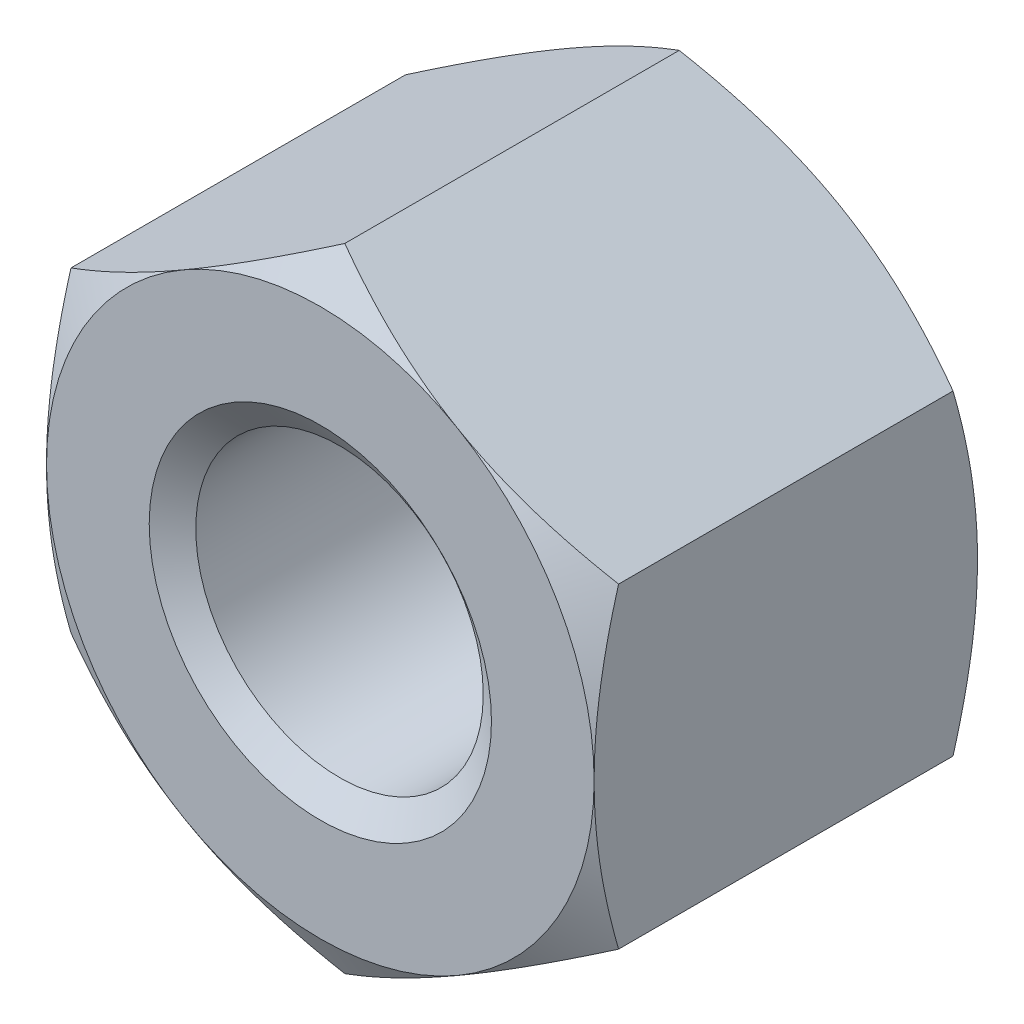
ISO-10303-21;
HEADER;
FILE_DESCRIPTION(('STEP AP214'),'2;1');
FILE_NAME('part.step','',(''),(''),'','','');
FILE_SCHEMA(('AUTOMOTIVE_DESIGN { 1 0 10303 214 1 1 1 1 }'));
ENDSEC;
DATA;
#1=APPLICATION_CONTEXT('core data for automotive mechanical design processes');
#2=APPLICATION_PROTOCOL_DEFINITION('international standard','automotive_design',2000,#1);
#3=PRODUCT_CONTEXT('',#1,'mechanical');
#4=PRODUCT('Part','Part','',(#3));
#5=PRODUCT_RELATED_PRODUCT_CATEGORY('part','',(#4));
#6=PRODUCT_DEFINITION_FORMATION('','',#4);
#7=PRODUCT_DEFINITION_CONTEXT('part definition',#1,'design');
#8=PRODUCT_DEFINITION('design','',#6,#7);
#9=PRODUCT_DEFINITION_SHAPE('','',#8);
#10=(LENGTH_UNIT() NAMED_UNIT(*) SI_UNIT(.MILLI.,.METRE.));
#11=(NAMED_UNIT(*) PLANE_ANGLE_UNIT() SI_UNIT($,.RADIAN.));
#12=(NAMED_UNIT(*) SI_UNIT($,.STERADIAN.) SOLID_ANGLE_UNIT());
#13=UNCERTAINTY_MEASURE_WITH_UNIT(LENGTH_MEASURE(1.E-05),#10,'distance_accuracy_value','');
#14=(GEOMETRIC_REPRESENTATION_CONTEXT(3) GLOBAL_UNCERTAINTY_ASSIGNED_CONTEXT((#13)) GLOBAL_UNIT_ASSIGNED_CONTEXT((#10,
#11,#12)) REPRESENTATION_CONTEXT('',''));
#15=CARTESIAN_POINT('',(0.,0.,0.));
#16=DIRECTION('',(0.,0.,1.));
#17=DIRECTION('',(1.,0.,0.));
#18=AXIS2_PLACEMENT_3D('',#15,#16,#17);
#19=CARTESIAN_POINT('',(0.,0.,-5.6));
#20=DIRECTION('',(0.,0.,1.));
#21=DIRECTION('',(1.,0.,0.));
#22=AXIS2_PLACEMENT_3D('',#19,#20,#21);
#23=CYLINDRICAL_SURFACE('',#22,2.1);
#24=CARTESIAN_POINT('',(0.,0.,-0.280083015283883));
#25=DIRECTION('',(0.,0.,1.));
#26=DIRECTION('',(1.,0.,0.));
#27=AXIS2_PLACEMENT_3D('',#24,#25,#26);
#28=CIRCLE('',#27,2.1);
#29=CARTESIAN_POINT('',(2.1,0.,-0.280083015283883));
#30=VERTEX_POINT('',#29);
#31=EDGE_CURVE('E170',#30,#30,#28,.F.);
#32=ORIENTED_EDGE('',*,*,#31,.F.);
#33=EDGE_LOOP('',(#32));
#34=FACE_BOUND('',#33,.T.);
#35=CARTESIAN_POINT('',(0.,0.,-5.29451698471611));
#36=DIRECTION('',(0.,0.,-1.));
#37=DIRECTION('',(-1.,0.,0.));
#38=AXIS2_PLACEMENT_3D('',#35,#36,#37);
#39=CIRCLE('',#38,2.1);
#40=CARTESIAN_POINT('',(-2.1,0.,-5.29451698471611));
#41=VERTEX_POINT('',#40);
#42=EDGE_CURVE('E35',#41,#41,#39,.F.);
#43=ORIENTED_EDGE('',*,*,#42,.F.);
#44=EDGE_LOOP('',(#43));
#45=FACE_BOUND('',#44,.T.);
#46=ADVANCED_FACE('F30',(#34,#45),#23,.F.);
#47=CARTESIAN_POINT('',(0.,4.61880215351702,-5.6));
#48=DIRECTION('',(0.,0.,-1.));
#49=DIRECTION('',(-1.,0.,0.));
#50=AXIS2_PLACEMENT_3D('',#47,#48,#49);
#51=PLANE('',#50);
#52=CARTESIAN_POINT('',(0.,0.,-5.6));
#53=DIRECTION('',(0.,0.,-1.));
#54=DIRECTION('',(-1.,0.,0.));
#55=AXIS2_PLACEMENT_3D('',#52,#53,#54);
#56=CIRCLE('',#55,4.);
#57=CARTESIAN_POINT('',(-4.,0.,-5.6));
#58=VERTEX_POINT('',#57);
#59=CARTESIAN_POINT('',(-2.00000000000002,-3.46410161513774,-5.6));
#60=VERTEX_POINT('',#59);
#61=EDGE_CURVE('E166',#58,#60,#56,.F.);
#62=ORIENTED_EDGE('',*,*,#61,.F.);
#63=CARTESIAN_POINT('',(-2.00000000000001,3.46410161513775,-5.6));
#64=VERTEX_POINT('',#63);
#65=EDGE_CURVE('E148',#64,#58,#56,.F.);
#66=ORIENTED_EDGE('',*,*,#65,.F.);
#67=CARTESIAN_POINT('',(2.00000000000003,3.46410161513774,-5.6));
#68=VERTEX_POINT('',#67);
#69=EDGE_CURVE('E165',#68,#64,#56,.F.);
#70=ORIENTED_EDGE('',*,*,#69,.F.);
#71=CARTESIAN_POINT('',(0.,0.,-5.6));
#72=DIRECTION('',(0.,0.,1.));
#73=DIRECTION('',(1.,0.,0.));
#74=AXIS2_PLACEMENT_3D('',#71,#72,#73);
#75=CIRCLE('',#74,4.);
#76=CARTESIAN_POINT('',(4.,0.,-5.6));
#77=VERTEX_POINT('',#76);
#78=EDGE_CURVE('E240',#77,#68,#75,.T.);
#79=ORIENTED_EDGE('',*,*,#78,.F.);
#80=CARTESIAN_POINT('',(2.00000000000001,-3.46410161513775,-5.6));
#81=VERTEX_POINT('',#80);
#82=EDGE_CURVE('E356',#81,#77,#56,.F.);
#83=ORIENTED_EDGE('',*,*,#82,.F.);
#84=EDGE_CURVE('E360',#60,#81,#56,.F.);
#85=ORIENTED_EDGE('',*,*,#84,.F.);
#86=EDGE_LOOP('',(#62,#66,#70,#79,#83,#85));
#87=FACE_BOUND('',#86,.T.);
#88=CARTESIAN_POINT('',(0.,0.,-5.6));
#89=DIRECTION('',(0.,0.,-1.));
#90=DIRECTION('',(-1.,0.,0.));
#91=AXIS2_PLACEMENT_3D('',#88,#89,#90);
#92=CIRCLE('',#91,2.5);
#93=CARTESIAN_POINT('',(-2.5,0.,-5.6));
#94=VERTEX_POINT('',#93);
#95=EDGE_CURVE('E173',#94,#94,#92,.F.);
#96=ORIENTED_EDGE('',*,*,#95,.T.);
#97=EDGE_LOOP('',(#96));
#98=FACE_BOUND('',#97,.T.);
#99=ADVANCED_FACE('F293',(#87,#98),#51,.T.);
#100=CARTESIAN_POINT('',(0.,4.61880215351702,0.));
#101=DIRECTION('',(0.,0.,-1.));
#102=DIRECTION('',(-1.,0.,0.));
#103=AXIS2_PLACEMENT_3D('',#100,#101,#102);
#104=PLANE('',#103);
#105=CARTESIAN_POINT('',(0.,0.,0.));
#106=DIRECTION('',(0.,0.,-1.));
#107=DIRECTION('',(-1.,0.,0.));
#108=AXIS2_PLACEMENT_3D('',#105,#106,#107);
#109=CIRCLE('',#108,4.);
#110=CARTESIAN_POINT('',(-4.,0.,0.));
#111=VERTEX_POINT('',#110);
#112=CARTESIAN_POINT('',(-2.00000000000001,3.46410161513775,0.));
#113=VERTEX_POINT('',#112);
#114=EDGE_CURVE('E11',#111,#113,#109,.T.);
#115=ORIENTED_EDGE('',*,*,#114,.F.);
#116=CARTESIAN_POINT('',(-2.00000000000002,-3.46410161513774,0.));
#117=VERTEX_POINT('',#116);
#118=EDGE_CURVE('E42',#117,#111,#109,.T.);
#119=ORIENTED_EDGE('',*,*,#118,.F.);
#120=CARTESIAN_POINT('',(2.00000000000001,-3.46410161513775,0.));
#121=VERTEX_POINT('',#120);
#122=EDGE_CURVE('E169',#121,#117,#109,.T.);
#123=ORIENTED_EDGE('',*,*,#122,.F.);
#124=CARTESIAN_POINT('',(4.,0.,0.));
#125=VERTEX_POINT('',#124);
#126=EDGE_CURVE('E347',#125,#121,#109,.T.);
#127=ORIENTED_EDGE('',*,*,#126,.F.);
#128=CARTESIAN_POINT('',(0.,0.,0.));
#129=DIRECTION('',(0.,0.,1.));
#130=DIRECTION('',(1.,0.,0.));
#131=AXIS2_PLACEMENT_3D('',#128,#129,#130);
#132=CIRCLE('',#131,4.);
#133=CARTESIAN_POINT('',(2.00000000000003,3.46410161513774,0.));
#134=VERTEX_POINT('',#133);
#135=EDGE_CURVE('E124',#125,#134,#132,.T.);
#136=ORIENTED_EDGE('',*,*,#135,.T.);
#137=EDGE_CURVE('E40',#113,#134,#109,.T.);
#138=ORIENTED_EDGE('',*,*,#137,.F.);
#139=EDGE_LOOP('',(#115,#119,#123,#127,#136,#138));
#140=FACE_BOUND('',#139,.T.);
#141=CARTESIAN_POINT('',(0.,0.,0.));
#142=DIRECTION('',(0.,0.,1.));
#143=DIRECTION('',(1.,0.,0.));
#144=AXIS2_PLACEMENT_3D('',#141,#142,#143);
#145=CIRCLE('',#144,2.5);
#146=CARTESIAN_POINT('',(2.5,0.,0.));
#147=VERTEX_POINT('',#146);
#148=EDGE_CURVE('E172',#147,#147,#145,.T.);
#149=ORIENTED_EDGE('',*,*,#148,.F.);
#150=EDGE_LOOP('',(#149));
#151=FACE_BOUND('',#150,.T.);
#152=ADVANCED_FACE('F245',(#140,#151),#104,.F.);
#153=CARTESIAN_POINT('',(0.,4.61880215351702,-5.6));
#154=DIRECTION('',(-0.500000000000002,0.866025403784437,0.));
#155=DIRECTION('',(-0.866025403784437,-0.500000000000002,0.));
#156=AXIS2_PLACEMENT_3D('',#153,#154,#155);
#157=PLANE('',#156);
#158=DIRECTION('',(0.,0.,1.));
#159=VECTOR('',#158,1.);
#160=CARTESIAN_POINT('',(-4.,2.3094010767585,-5.6));
#161=LINE('',#160,#159);
#162=CARTESIAN_POINT('',(-4.,2.30940107675853,-5.24273441009183));
#163=VERTEX_POINT('',#162);
#164=CARTESIAN_POINT('',(-4.,2.3094010767585,-0.357265589908163));
#165=VERTEX_POINT('',#164);
#166=EDGE_CURVE('E160',#163,#165,#161,.T.);
#167=ORIENTED_EDGE('',*,*,#166,.T.);
#168=CARTESIAN_POINT('',(-4.0002,2.30928560670466,-0.357332259074767));
#169=CARTESIAN_POINT('',(-3.82442084967677,2.4107717464617,-0.298717873648282));
#170=CARTESIAN_POINT('',(-3.64712438367362,2.51313390883499,-0.245410321462262));
#171=CARTESIAN_POINT('',(-3.28946140682429,2.71963072479811,-0.152361670746403));
#172=CARTESIAN_POINT('',(-3.10908854102985,2.82376904741904,-0.112653489029703));
#173=CARTESIAN_POINT('',(-2.75057818129721,3.03075510011795,-0.0508422152802778));
#174=CARTESIAN_POINT('',(-2.57249584706486,3.13357098372491,-0.0283277315228875));
#175=CARTESIAN_POINT('',(-2.21549328283349,3.33968651028528,-0.00145062314658082));
#176=CARTESIAN_POINT('',(-2.0365743503559,3.44298540411434,0.00293425857305745));
#177=CARTESIAN_POINT('',(-1.70225715780327,3.63600352522932,-0.00619007293997034));
#178=CARTESIAN_POINT('',(-1.54680884001293,3.72575165335065,-0.0174589539879949));
#179=CARTESIAN_POINT('',(-1.23692494436494,3.90466320392055,-0.0531739907981951));
#180=CARTESIAN_POINT('',(-1.08249043825587,3.99382600759479,-0.0776323457115357));
#181=CARTESIAN_POINT('',(-0.771967672225416,4.17310641015198,-0.138776064919294));
#182=CARTESIAN_POINT('',(-0.61591871193689,4.26320131938132,-0.175720603654869));
#183=CARTESIAN_POINT('',(-0.306148164596151,4.44204742827552,-0.259570072548035));
#184=CARTESIAN_POINT('',(-0.15242260922621,4.53080091904968,-0.306455302212749));
#185=CARTESIAN_POINT('',(0.000200000000011907,4.61891762357086,-0.357332259074778));
#186=B_SPLINE_CURVE_WITH_KNOTS('',3,(#168,#169,#170,#171,#172,#173,#174,#175,#176,#177,#178,
#179,#180,#181,#182,#183,#184,#185),.UNSPECIFIED.,.F.,.F.,(4,2,2,2,2,2,2,2,4),(0.,
0.634047835695967,1.26961969224544,1.88946157213122,2.50854226669297,3.04757825393386,
3.58711366126904,4.13861653143765,4.68903648037745),.UNSPECIFIED.);
#187=EDGE_CURVE('E129',#165,#113,#186,.T.);
#188=ORIENTED_EDGE('',*,*,#187,.T.);
#189=CARTESIAN_POINT('',(0.,4.61880215351702,-0.357265589908173));
#190=VERTEX_POINT('',#189);
#191=EDGE_CURVE('E49',#113,#190,#186,.T.);
#192=ORIENTED_EDGE('',*,*,#191,.T.);
#193=DIRECTION('',(0.,0.,1.));
#194=VECTOR('',#193,1.);
#195=CARTESIAN_POINT('',(0.,4.61880215351702,-5.6));
#196=LINE('',#195,#194);
#197=CARTESIAN_POINT('',(0.,4.61880215351702,-5.24273441009183));
#198=VERTEX_POINT('',#197);
#199=EDGE_CURVE('E145',#198,#190,#196,.T.);
#200=ORIENTED_EDGE('',*,*,#199,.F.);
#201=CARTESIAN_POINT('',(-4.0002,2.30928560670466,-5.24266774092523));
#202=CARTESIAN_POINT('',(-3.82442084967677,2.4107717464617,-5.30128212635172));
#203=CARTESIAN_POINT('',(-3.64712438367362,2.51313390883499,-5.35458967853774));
#204=CARTESIAN_POINT('',(-3.28946140682429,2.71963072479811,-5.4476383292536));
#205=CARTESIAN_POINT('',(-3.10908854102985,2.82376904741904,-5.4873465109703));
#206=CARTESIAN_POINT('',(-2.75057818129721,3.03075510011795,-5.54915778471972));
#207=CARTESIAN_POINT('',(-2.57249584706486,3.13357098372491,-5.57167226847711));
#208=CARTESIAN_POINT('',(-2.21549328283349,3.33968651028528,-5.59854937685342));
#209=CARTESIAN_POINT('',(-2.0365743503559,3.44298540411434,-5.60293425857306));
#210=CARTESIAN_POINT('',(-1.70225715780327,3.63600352522932,-5.59380992706003));
#211=CARTESIAN_POINT('',(-1.54680884001293,3.72575165335065,-5.58254104601201));
#212=CARTESIAN_POINT('',(-1.23692494436494,3.90466320392055,-5.54682600920181));
#213=CARTESIAN_POINT('',(-1.08249043825587,3.99382600759479,-5.52236765428847));
#214=CARTESIAN_POINT('',(-0.771967672225416,4.17310641015198,-5.46122393508071));
#215=CARTESIAN_POINT('',(-0.61591871193689,4.26320131938132,-5.42427939634513));
#216=CARTESIAN_POINT('',(-0.306148164596151,4.44204742827552,-5.34042992745197));
#217=CARTESIAN_POINT('',(-0.15242260922621,4.53080091904968,-5.29354469778725));
#218=CARTESIAN_POINT('',(0.000200000000011775,4.61891762357086,-5.24266774092522));
#219=B_SPLINE_CURVE_WITH_KNOTS('',3,(#201,#202,#203,#204,#205,#206,#207,#208,#209,#210,#211,
#212,#213,#214,#215,#216,#217,#218),.UNSPECIFIED.,.F.,.F.,(4,2,2,2,2,2,2,2,4),(0.,
0.634047835695967,1.26961969224544,1.88946157213122,2.50854226669297,3.04757825393386,
3.58711366126905,4.13861653143765,4.68903648037745),.UNSPECIFIED.);
#220=EDGE_CURVE('E163',#64,#198,#219,.T.);
#221=ORIENTED_EDGE('',*,*,#220,.F.);
#222=EDGE_CURVE('E255',#163,#64,#219,.T.);
#223=ORIENTED_EDGE('',*,*,#222,.F.);
#224=EDGE_LOOP('',(#167,#188,#192,#200,#221,#223));
#225=FACE_BOUND('',#224,.T.);
#226=ADVANCED_FACE('F32',(#225),#157,.T.);
#227=CARTESIAN_POINT('',(4.,2.30940107675848,-5.6));
#228=DIRECTION('',(0.500000000000007,0.866025403784435,0.));
#229=DIRECTION('',(-0.866025403784435,0.500000000000007,0.));
#230=AXIS2_PLACEMENT_3D('',#227,#228,#229);
#231=PLANE('',#230);
#232=ORIENTED_EDGE('',*,*,#199,.T.);
#233=CARTESIAN_POINT('',(-0.00019999999998845,4.61891762357086,-0.357332259074777));
#234=CARTESIAN_POINT('',(0.175579150323239,4.51743148381382,-0.298717873648291));
#235=CARTESIAN_POINT('',(0.352875616326392,4.41506932144053,-0.245410321462271));
#236=CARTESIAN_POINT('',(0.710538593175717,4.2085725054774,-0.15236167074641));
#237=CARTESIAN_POINT('',(0.890911458970161,4.10443418285647,-0.112653489029709));
#238=CARTESIAN_POINT('',(1.2494218187028,3.89744813015756,-0.0508422152802821));
#239=CARTESIAN_POINT('',(1.42750415293515,3.79463224655059,-0.0283277315228906));
#240=CARTESIAN_POINT('',(1.78450671716652,3.58851671999022,-0.00145062314658197));
#241=CARTESIAN_POINT('',(1.96342564964411,3.48521782616116,0.00293425857305705));
#242=CARTESIAN_POINT('',(2.29774284219674,3.29219970504618,-0.00619007293996901));
#243=CARTESIAN_POINT('',(2.45319115998708,3.20245157692485,-0.0174589539879924));
#244=CARTESIAN_POINT('',(2.76307505563506,3.02354002635495,-0.0531739907981907));
#245=CARTESIAN_POINT('',(2.91750956174414,2.93437722268071,-0.0776323457115305));
#246=CARTESIAN_POINT('',(3.22803232777459,2.75509682012352,-0.138776064919287));
#247=CARTESIAN_POINT('',(3.38408128806311,2.66500191089418,-0.175720603654861));
#248=CARTESIAN_POINT('',(3.69385183540384,2.48615580199999,-0.259570072548024));
#249=CARTESIAN_POINT('',(3.84757739077378,2.39740231122583,-0.306455302212737));
#250=CARTESIAN_POINT('',(4.0002,2.30928560670464,-0.357332259074764));
#251=B_SPLINE_CURVE_WITH_KNOTS('',3,(#233,#234,#235,#236,#237,#238,#239,#240,#241,#242,#243,
#244,#245,#246,#247,#248,#249,#250),.UNSPECIFIED.,.F.,.F.,(4,2,2,2,2,2,2,2,4),(0.,
0.634047835695968,1.26961969224544,1.88946157213123,2.50854226669298,3.04757825393387,
3.58711366126905,4.13861653143765,4.68903648037745),.UNSPECIFIED.);
#252=EDGE_CURVE('E139',#190,#134,#251,.T.);
#253=ORIENTED_EDGE('',*,*,#252,.T.);
#254=CARTESIAN_POINT('',(4.,2.30940107675852,-0.357265589908173));
#255=VERTEX_POINT('',#254);
#256=EDGE_CURVE('E56',#134,#255,#251,.T.);
#257=ORIENTED_EDGE('',*,*,#256,.T.);
#258=DIRECTION('',(0.,0.,1.));
#259=VECTOR('',#258,1.);
#260=CARTESIAN_POINT('',(4.,2.30940107675848,-5.6));
#261=LINE('',#260,#259);
#262=CARTESIAN_POINT('',(4.,2.30940107675852,-5.24273441009183));
#263=VERTEX_POINT('',#262);
#264=EDGE_CURVE('E138',#263,#255,#261,.T.);
#265=ORIENTED_EDGE('',*,*,#264,.F.);
#266=CARTESIAN_POINT('',(-0.00019999999998845,4.61891762357086,-5.24266774092522));
#267=CARTESIAN_POINT('',(0.17557915032324,4.51743148381382,-5.30128212635171));
#268=CARTESIAN_POINT('',(0.352875616326392,4.41506932144053,-5.35458967853773));
#269=CARTESIAN_POINT('',(0.710538593175717,4.2085725054774,-5.44763832925359));
#270=CARTESIAN_POINT('',(0.890911458970162,4.10443418285647,-5.48734651097029));
#271=CARTESIAN_POINT('',(1.2494218187028,3.89744813015756,-5.54915778471972));
#272=CARTESIAN_POINT('',(1.42750415293515,3.79463224655059,-5.57167226847711));
#273=CARTESIAN_POINT('',(1.78450671716652,3.58851671999022,-5.59854937685342));
#274=CARTESIAN_POINT('',(1.96342564964411,3.48521782616116,-5.60293425857306));
#275=CARTESIAN_POINT('',(2.29774284219674,3.29219970504618,-5.59380992706003));
#276=CARTESIAN_POINT('',(2.45319115998708,3.20245157692485,-5.58254104601201));
#277=CARTESIAN_POINT('',(2.76307505563506,3.02354002635495,-5.54682600920181));
#278=CARTESIAN_POINT('',(2.91750956174414,2.93437722268071,-5.52236765428847));
#279=CARTESIAN_POINT('',(3.22803232777458,2.75509682012352,-5.46122393508071));
#280=CARTESIAN_POINT('',(3.38408128806311,2.66500191089418,-5.42427939634514));
#281=CARTESIAN_POINT('',(3.69385183540384,2.48615580199999,-5.34042992745198));
#282=CARTESIAN_POINT('',(3.84757739077378,2.39740231122583,-5.29354469778726));
#283=CARTESIAN_POINT('',(4.0002,2.30928560670464,-5.24266774092524));
#284=B_SPLINE_CURVE_WITH_KNOTS('',3,(#266,#267,#268,#269,#270,#271,#272,#273,#274,#275,#276,
#277,#278,#279,#280,#281,#282,#283),.UNSPECIFIED.,.F.,.F.,(4,2,2,2,2,2,2,2,4),(0.,
0.634047835695969,1.26961969224544,1.88946157213123,2.50854226669298,3.04757825393387,
3.58711366126904,4.13861653143765,4.68903648037745),.UNSPECIFIED.);
#285=EDGE_CURVE('E249',#68,#263,#284,.T.);
#286=ORIENTED_EDGE('',*,*,#285,.F.);
#287=EDGE_CURVE('E254',#198,#68,#284,.T.);
#288=ORIENTED_EDGE('',*,*,#287,.F.);
#289=EDGE_LOOP('',(#232,#253,#257,#265,#286,#288));
#290=FACE_BOUND('',#289,.T.);
#291=ADVANCED_FACE('F136',(#290),#231,.T.);
#292=CARTESIAN_POINT('',(4.,2.30940107675848,-5.6));
#293=DIRECTION('',(-1.,0.,0.));
#294=DIRECTION('',(0.,0.,1.));
#295=AXIS2_PLACEMENT_3D('',#292,#293,#294);
#296=PLANE('',#295);
#297=CARTESIAN_POINT('',(4.,-6.12487198995896,-1.91410682124067));
#298=CARTESIAN_POINT('',(4.,-5.9492493703868,-1.82923627076692));
#299=CARTESIAN_POINT('',(4.,-5.7732115209529,-1.74520940380742));
#300=CARTESIAN_POINT('',(4.,-5.42008084777958,-1.57932514679719));
#301=CARTESIAN_POINT('',(4.,-5.24298784779931,-1.49746813236725));
#302=CARTESIAN_POINT('',(4.,-4.88656571686338,-1.33597446305858));
#303=CARTESIAN_POINT('',(4.,-4.70722958889366,-1.25635319506306));
#304=CARTESIAN_POINT('',(4.,-4.34708334747267,-1.10053058542032));
#305=CARTESIAN_POINT('',(4.,-4.16627331143541,-1.02432906550804));
#306=CARTESIAN_POINT('',(4.,-3.80064706744981,-0.875350650394381));
#307=CARTESIAN_POINT('',(4.,-3.61580892822773,-0.802627284215863));
#308=CARTESIAN_POINT('',(4.,-3.24395246794972,-0.662876230959436));
#309=CARTESIAN_POINT('',(4.,-3.05693390695805,-0.59584917756652));
#310=CARTESIAN_POINT('',(4.,-2.68080318253774,-0.469291748430896));
#311=CARTESIAN_POINT('',(4.,-2.49169643712852,-0.409745434783851));
#312=CARTESIAN_POINT('',(4.,-2.11079454635854,-0.300083356544518));
#313=CARTESIAN_POINT('',(4.,-1.91900027185752,-0.249964609676762));
#314=CARTESIAN_POINT('',(4.,-1.53259232698203,-0.16159079495405));
#315=CARTESIAN_POINT('',(4.,-1.33797792031653,-0.123338885956548));
#316=CARTESIAN_POINT('',(4.,-0.946402725872582,-0.0612742359223494));
#317=CARTESIAN_POINT('',(4.,-0.749441936019801,-0.0374615076517037));
#318=CARTESIAN_POINT('',(4.,-0.355451989627968,-0.00638181314943936));
#319=CARTESIAN_POINT('',(4.,-0.158431311094036,0.000989900761038723));
#320=CARTESIAN_POINT('',(4.,0.235472085607446,-0.00120406637479726));
#321=CARTESIAN_POINT('',(4.,0.432354826312183,-0.0107653508153518));
#322=CARTESIAN_POINT('',(4.,0.768560635225494,-0.040878734613591));
#323=CARTESIAN_POINT('',(4.,0.908254618381796,-0.0575092960439096));
#324=CARTESIAN_POINT('',(4.,1.18656349063495,-0.0982134103466906));
#325=CARTESIAN_POINT('',(4.,1.32517820601011,-0.122288137058445));
#326=CARTESIAN_POINT('',(4.,1.73929045452966,-0.204415070950227));
#327=CARTESIAN_POINT('',(4.,2.01284690528719,-0.272348886425149));
#328=CARTESIAN_POINT('',(4.,2.4221825301452,-0.389516359317197));
#329=CARTESIAN_POINT('',(4.,2.56009536361535,-0.43171394181163));
#330=CARTESIAN_POINT('',(4.,2.834481591014,-0.520284580227754));
#331=CARTESIAN_POINT('',(4.,2.97095590623554,-0.566654756186904));
#332=CARTESIAN_POINT('',(4.,3.24189440516337,-0.662605699180277));
#333=CARTESIAN_POINT('',(4.,3.37636557946834,-0.712166925753491));
#334=CARTESIAN_POINT('',(4.,3.6442646115291,-0.814198353790692));
#335=CARTESIAN_POINT('',(4.,3.77769202239383,-0.866669730963359));
#336=CARTESIAN_POINT('',(4.,3.9106369898668,-0.920309006541781));
#337=B_SPLINE_CURVE_WITH_KNOTS('',3,(#297,#298,#299,#300,#301,#302,#303,#304,#305,#306,#307,
#308,#309,#310,#311,#312,#313,#314,#315,#316,#317,#318,#319,#320,#321,#322,#323,#324,#325,#326,
#327,#328,#329,#330,#331,#332,#333,#334,#335,#336),.UNSPECIFIED.,.F.,.F.,(4,2,2,2,2,2,2,2,2,2,2,
2,2,2,2,2,2,2,2,4),(0.,0.585171792532274,1.17044423059927,1.7590659464599,2.34765694284827,
2.94347400997484,3.5393572721069,4.13394864697602,4.72835161391473,5.32291267067847,
5.91747425310815,6.50823685854039,7.09884609659889,7.52068140825524,7.94258327130842,
8.78701491359831,9.2196528189769,9.65199437116298,10.0819024146297,10.5119854255247),.UNSPECIFIED.);
#338=CARTESIAN_POINT('',(3.99999999999999,-2.30940107675855,-0.357265589908173));
#339=VERTEX_POINT('',#338);
#340=EDGE_CURVE('E131',#339,#125,#337,.T.);
#341=ORIENTED_EDGE('',*,*,#340,.F.);
#342=DIRECTION('',(0.,0.,1.));
#343=VECTOR('',#342,1.);
#344=CARTESIAN_POINT('',(4.,-2.30940107675854,-5.6));
#345=LINE('',#344,#343);
#346=CARTESIAN_POINT('',(3.99999999999999,-2.30940107675855,-5.24273441009183));
#347=VERTEX_POINT('',#346);
#348=EDGE_CURVE('E146',#347,#339,#345,.T.);
#349=ORIENTED_EDGE('',*,*,#348,.F.);
#350=CARTESIAN_POINT('',(4.,-6.12487198995896,-3.68589317875933));
#351=CARTESIAN_POINT('',(4.,-5.9492493703868,-3.77076372923308));
#352=CARTESIAN_POINT('',(4.,-5.7732115209529,-3.85479059619258));
#353=CARTESIAN_POINT('',(4.,-5.42008084777958,-4.02067485320281));
#354=CARTESIAN_POINT('',(4.,-5.24298784779932,-4.10253186763275));
#355=CARTESIAN_POINT('',(4.,-4.88656571686338,-4.26402553694142));
#356=CARTESIAN_POINT('',(4.,-4.70722958889366,-4.34364680493694));
#357=CARTESIAN_POINT('',(4.,-4.34708334747267,-4.49946941457968));
#358=CARTESIAN_POINT('',(4.,-4.16627331143541,-4.57567093449196));
#359=CARTESIAN_POINT('',(4.,-3.80064706744981,-4.72464934960562));
#360=CARTESIAN_POINT('',(4.,-3.61580892822773,-4.79737271578414));
#361=CARTESIAN_POINT('',(4.,-3.24395246794972,-4.93712376904056));
#362=CARTESIAN_POINT('',(4.,-3.05693390695805,-5.00415082243348));
#363=CARTESIAN_POINT('',(4.,-2.68080318253774,-5.13070825156911));
#364=CARTESIAN_POINT('',(4.,-2.49169643712852,-5.19025456521615));
#365=CARTESIAN_POINT('',(4.,-2.11079454635854,-5.29991664345548));
#366=CARTESIAN_POINT('',(4.,-1.91900027185752,-5.35003539032324));
#367=CARTESIAN_POINT('',(4.,-1.53259232698203,-5.43840920504595));
#368=CARTESIAN_POINT('',(4.,-1.33797792031653,-5.47666111404345));
#369=CARTESIAN_POINT('',(4.,-0.946402725872582,-5.53872576407765));
#370=CARTESIAN_POINT('',(4.,-0.749441936019801,-5.5625384923483));
#371=CARTESIAN_POINT('',(4.,-0.355451989627969,-5.59361818685056));
#372=CARTESIAN_POINT('',(4.,-0.158431311094036,-5.60098990076104));
#373=CARTESIAN_POINT('',(4.,0.235472085607445,-5.5987959336252));
#374=CARTESIAN_POINT('',(4.,0.432354826312183,-5.58923464918465));
#375=CARTESIAN_POINT('',(4.,0.768560635225494,-5.55912126538641));
#376=CARTESIAN_POINT('',(4.,0.908254618381795,-5.54249070395609));
#377=CARTESIAN_POINT('',(4.,1.18656349063495,-5.50178658965331));
#378=CARTESIAN_POINT('',(4.,1.32517820601011,-5.47771186294156));
#379=CARTESIAN_POINT('',(4.,1.73929045452966,-5.39558492904977));
#380=CARTESIAN_POINT('',(4.,2.01284690528719,-5.32765111357485));
#381=CARTESIAN_POINT('',(4.,2.4221825301452,-5.2104836406828));
#382=CARTESIAN_POINT('',(4.,2.56009536361535,-5.16828605818837));
#383=CARTESIAN_POINT('',(4.,2.834481591014,-5.07971541977225));
#384=CARTESIAN_POINT('',(4.,2.97095590623554,-5.0333452438131));
#385=CARTESIAN_POINT('',(4.,3.24189440516337,-4.93739430081972));
#386=CARTESIAN_POINT('',(4.,3.37636557946834,-4.88783307424651));
#387=CARTESIAN_POINT('',(4.,3.6442646115291,-4.78580164620931));
#388=CARTESIAN_POINT('',(4.,3.77769202239383,-4.73333026903664));
#389=CARTESIAN_POINT('',(4.,3.9106369898668,-4.67969099345822));
#390=B_SPLINE_CURVE_WITH_KNOTS('',3,(#350,#351,#352,#353,#354,#355,#356,#357,#358,#359,#360,
#361,#362,#363,#364,#365,#366,#367,#368,#369,#370,#371,#372,#373,#374,#375,#376,#377,#378,#379,
#380,#381,#382,#383,#384,#385,#386,#387,#388,#389),.UNSPECIFIED.,.F.,.F.,(4,2,2,2,2,2,2,2,2,2,2,
2,2,2,2,2,2,2,2,4),(0.,0.585171792532273,1.17044423059927,1.7590659464599,2.34765694284827,
2.94347400997484,3.5393572721069,4.13394864697602,4.72835161391472,5.32291267067847,
5.91747425310815,6.50823685854039,7.09884609659889,7.52068140825523,7.94258327130841,
8.78701491359831,9.2196528189769,9.65199437116298,10.0819024146297,10.5119854255247),.UNSPECIFIED.);
#391=EDGE_CURVE('E261',#347,#77,#390,.T.);
#392=ORIENTED_EDGE('',*,*,#391,.T.);
#393=EDGE_CURVE('E144',#77,#263,#390,.T.);
#394=ORIENTED_EDGE('',*,*,#393,.T.);
#395=ORIENTED_EDGE('',*,*,#264,.T.);
#396=EDGE_CURVE('E121',#125,#255,#337,.T.);
#397=ORIENTED_EDGE('',*,*,#396,.F.);
#398=EDGE_LOOP('',(#341,#349,#392,#394,#395,#397));
#399=FACE_BOUND('',#398,.T.);
#400=ADVANCED_FACE('F142',(#399),#296,.F.);
#401=CARTESIAN_POINT('',(0.,-4.61880215351706,-5.6));
#402=DIRECTION('',(0.500000000000003,-0.866025403784437,0.));
#403=DIRECTION('',(0.866025403784437,0.500000000000003,0.));
#404=AXIS2_PLACEMENT_3D('',#401,#402,#403);
#405=PLANE('',#404);
#406=ORIENTED_EDGE('',*,*,#348,.T.);
#407=CARTESIAN_POINT('',(4.0002,-2.3092856067047,-0.357332259074782));
#408=CARTESIAN_POINT('',(3.82442084967677,-2.41077174646174,-0.298717873648298));
#409=CARTESIAN_POINT('',(3.64712438367362,-2.51313390883503,-0.245410321462278));
#410=CARTESIAN_POINT('',(3.28946140682429,-2.71963072479816,-0.15236167074642));
#411=CARTESIAN_POINT('',(3.10908854102985,-2.82376904741909,-0.112653489029721));
#412=CARTESIAN_POINT('',(2.75057818129721,-3.030755100118,-0.0508422152802971));
#413=CARTESIAN_POINT('',(2.57249584706485,-3.13357098372496,-0.028327731522908));
#414=CARTESIAN_POINT('',(2.21549328283349,-3.33968651028533,-0.00145062314660313));
#415=CARTESIAN_POINT('',(2.03657435035589,-3.44298540411439,0.00293425857303443));
#416=CARTESIAN_POINT('',(1.70225715780326,-3.63600352522937,-0.0061900729399952));
#417=CARTESIAN_POINT('',(1.54680884001293,-3.7257516533507,-0.0174589539880206));
#418=CARTESIAN_POINT('',(1.23692494436494,-3.9046632039206,-0.0531739907982214));
#419=CARTESIAN_POINT('',(1.08249043825586,-3.99382600759484,-0.077632345711562));
#420=CARTESIAN_POINT('',(0.771967672225417,-4.17310641015202,-0.13877606491932));
#421=CARTESIAN_POINT('',(0.615918711936894,-4.26320131938137,-0.175720603654895));
#422=CARTESIAN_POINT('',(0.306148164596158,-4.44204742827556,-0.25957007254806));
#423=CARTESIAN_POINT('',(0.152422609226218,-4.53080091904972,-0.306455302212774));
#424=CARTESIAN_POINT('',(-0.000200000000002422,-4.6189176235709,-0.357332259074802));
#425=B_SPLINE_CURVE_WITH_KNOTS('',3,(#407,#408,#409,#410,#411,#412,#413,#414,#415,#416,#417,
#418,#419,#420,#421,#422,#423,#424),.UNSPECIFIED.,.F.,.F.,(4,2,2,2,2,2,2,2,4),(0.,
0.63404783569597,1.26961969224544,1.88946157213123,2.50854226669299,3.04757825393387,
3.58711366126905,4.13861653143765,4.68903648037745),.UNSPECIFIED.);
#426=EDGE_CURVE('E342',#339,#121,#425,.T.);
#427=ORIENTED_EDGE('',*,*,#426,.T.);
#428=CARTESIAN_POINT('',(0.,-4.61880215351702,-0.357265589908173));
#429=VERTEX_POINT('',#428);
#430=EDGE_CURVE('E221',#121,#429,#425,.T.);
#431=ORIENTED_EDGE('',*,*,#430,.T.);
#432=DIRECTION('',(0.,0.,1.));
#433=VECTOR('',#432,1.);
#434=CARTESIAN_POINT('',(0.,-4.61880215351706,-5.6));
#435=LINE('',#434,#433);
#436=CARTESIAN_POINT('',(0.,-4.61880215351702,-5.24273441009183));
#437=VERTEX_POINT('',#436);
#438=EDGE_CURVE('E151',#437,#429,#435,.T.);
#439=ORIENTED_EDGE('',*,*,#438,.F.);
#440=CARTESIAN_POINT('',(4.0002,-2.3092856067047,-5.24266774092522));
#441=CARTESIAN_POINT('',(3.82442084967678,-2.41077174646174,-5.3012821263517));
#442=CARTESIAN_POINT('',(3.64712438367362,-2.51313390883503,-5.35458967853772));
#443=CARTESIAN_POINT('',(3.28946140682429,-2.71963072479816,-5.44763832925358));
#444=CARTESIAN_POINT('',(3.10908854102985,-2.82376904741909,-5.48734651097028));
#445=CARTESIAN_POINT('',(2.75057818129721,-3.030755100118,-5.5491577847197));
#446=CARTESIAN_POINT('',(2.57249584706485,-3.13357098372496,-5.57167226847709));
#447=CARTESIAN_POINT('',(2.21549328283349,-3.33968651028533,-5.5985493768534));
#448=CARTESIAN_POINT('',(2.03657435035589,-3.44298540411439,-5.60293425857304));
#449=CARTESIAN_POINT('',(1.70225715780326,-3.63600352522937,-5.59380992706001));
#450=CARTESIAN_POINT('',(1.54680884001293,-3.7257516533507,-5.58254104601198));
#451=CARTESIAN_POINT('',(1.23692494436494,-3.9046632039206,-5.54682600920178));
#452=CARTESIAN_POINT('',(1.08249043825586,-3.99382600759484,-5.52236765428844));
#453=CARTESIAN_POINT('',(0.771967672225418,-4.17310641015202,-5.46122393508068));
#454=CARTESIAN_POINT('',(0.615918711936894,-4.26320131938136,-5.42427939634511));
#455=CARTESIAN_POINT('',(0.306148164596157,-4.44204742827556,-5.34042992745194));
#456=CARTESIAN_POINT('',(0.152422609226217,-4.53080091904972,-5.29354469778723));
#457=CARTESIAN_POINT('',(-0.000200000000002432,-4.6189176235709,-5.2426677409252));
#458=B_SPLINE_CURVE_WITH_KNOTS('',3,(#440,#441,#442,#443,#444,#445,#446,#447,#448,#449,#450,
#451,#452,#453,#454,#455,#456,#457),.UNSPECIFIED.,.F.,.F.,(4,2,2,2,2,2,2,2,4),(0.,
0.63404783569597,1.26961969224544,1.88946157213123,2.50854226669299,3.04757825393387,
3.58711366126905,4.13861653143765,4.68903648037745),.UNSPECIFIED.);
#459=EDGE_CURVE('E267',#81,#437,#458,.T.);
#460=ORIENTED_EDGE('',*,*,#459,.F.);
#461=EDGE_CURVE('E266',#347,#81,#458,.T.);
#462=ORIENTED_EDGE('',*,*,#461,.F.);
#463=EDGE_LOOP('',(#406,#427,#431,#439,#460,#462));
#464=FACE_BOUND('',#463,.T.);
#465=ADVANCED_FACE('F277',(#464),#405,.T.);
#466=CARTESIAN_POINT('',(-4.,-2.30940107675853,-5.6));
#467=DIRECTION('',(-0.500000000000006,-0.866025403784435,0.));
#468=DIRECTION('',(0.866025403784436,-0.500000000000006,0.));
#469=AXIS2_PLACEMENT_3D('',#466,#467,#468);
#470=PLANE('',#469);
#471=ORIENTED_EDGE('',*,*,#438,.T.);
#472=CARTESIAN_POINT('',(0.000199999999997729,-4.6189176235709,-0.357332259074802));
#473=CARTESIAN_POINT('',(-0.175579150323232,-4.51743148381386,-0.298717873648315));
#474=CARTESIAN_POINT('',(-0.352875616326386,-4.41506932144057,-0.245410321462294));
#475=CARTESIAN_POINT('',(-0.710538593175715,-4.20857250547744,-0.152361670746431));
#476=CARTESIAN_POINT('',(-0.890911458970161,-4.10443418285651,-0.112653489029731));
#477=CARTESIAN_POINT('',(-1.2494218187028,-3.8974481301576,-0.0508422152803029));
#478=CARTESIAN_POINT('',(-1.42750415293516,-3.79463224655063,-0.0283277315229116));
#479=CARTESIAN_POINT('',(-1.78450671716653,-3.58851671999026,-0.00145062314660233));
#480=CARTESIAN_POINT('',(-1.96342564964412,-3.4852178261612,0.00293425857303738));
#481=CARTESIAN_POINT('',(-2.29774284219675,-3.29219970504621,-0.00619007293998834));
#482=CARTESIAN_POINT('',(-2.45319115998708,-3.20245157692489,-0.0174589539880117));
#483=CARTESIAN_POINT('',(-2.76307505563507,-3.02354002635499,-0.0531739907982092));
#484=CARTESIAN_POINT('',(-2.91750956174414,-2.93437722268075,-0.0776323457115483));
#485=CARTESIAN_POINT('',(-3.22803232777459,-2.75509682012356,-0.138776064919303));
#486=CARTESIAN_POINT('',(-3.38408128806311,-2.66500191089422,-0.175720603654876));
#487=CARTESIAN_POINT('',(-3.69385183540384,-2.48615580200003,-0.259570072548038));
#488=CARTESIAN_POINT('',(-3.84757739077378,-2.39740231122587,-0.30645530221275));
#489=CARTESIAN_POINT('',(-4.0002,-2.30928560670469,-0.357332259074776));
#490=B_SPLINE_CURVE_WITH_KNOTS('',3,(#472,#473,#474,#475,#476,#477,#478,#479,#480,#481,#482,
#483,#484,#485,#486,#487,#488,#489),.UNSPECIFIED.,.F.,.F.,(4,2,2,2,2,2,2,2,4),(0.,
0.634047835695975,1.26961969224545,1.88946157213125,2.508542266693,3.04757825393389,
3.58711366126906,4.13861653143766,4.68903648037745),.UNSPECIFIED.);
#491=EDGE_CURVE('E340',#429,#117,#490,.T.);
#492=ORIENTED_EDGE('',*,*,#491,.T.);
#493=CARTESIAN_POINT('',(-4.,-2.30940107675853,-0.357265589908173));
#494=VERTEX_POINT('',#493);
#495=EDGE_CURVE('E195',#117,#494,#490,.T.);
#496=ORIENTED_EDGE('',*,*,#495,.T.);
#497=DIRECTION('',(0.,0.,1.));
#498=VECTOR('',#497,1.);
#499=CARTESIAN_POINT('',(-4.,-2.30940107675853,-5.6));
#500=LINE('',#499,#498);
#501=CARTESIAN_POINT('',(-4.,-2.30940107675853,-5.24273441009183));
#502=VERTEX_POINT('',#501);
#503=EDGE_CURVE('E157',#502,#494,#500,.T.);
#504=ORIENTED_EDGE('',*,*,#503,.F.);
#505=CARTESIAN_POINT('',(0.000199999999997729,-4.6189176235709,-5.2426677409252));
#506=CARTESIAN_POINT('',(-0.175579150323232,-4.51743148381386,-5.30128212635169));
#507=CARTESIAN_POINT('',(-0.352875616326386,-4.41506932144057,-5.35458967853771));
#508=CARTESIAN_POINT('',(-0.710538593175715,-4.20857250547744,-5.44763832925357));
#509=CARTESIAN_POINT('',(-0.890911458970161,-4.10443418285651,-5.48734651097027));
#510=CARTESIAN_POINT('',(-1.2494218187028,-3.8974481301576,-5.5491577847197));
#511=CARTESIAN_POINT('',(-1.42750415293516,-3.79463224655063,-5.57167226847709));
#512=CARTESIAN_POINT('',(-1.78450671716653,-3.58851671999026,-5.5985493768534));
#513=CARTESIAN_POINT('',(-1.96342564964412,-3.4852178261612,-5.60293425857304));
#514=CARTESIAN_POINT('',(-2.29774284219675,-3.29219970504621,-5.59380992706001));
#515=CARTESIAN_POINT('',(-2.45319115998708,-3.20245157692489,-5.58254104601199));
#516=CARTESIAN_POINT('',(-2.76307505563507,-3.02354002635499,-5.54682600920179));
#517=CARTESIAN_POINT('',(-2.91750956174414,-2.93437722268075,-5.52236765428845));
#518=CARTESIAN_POINT('',(-3.22803232777459,-2.75509682012356,-5.4612239350807));
#519=CARTESIAN_POINT('',(-3.38408128806311,-2.66500191089422,-5.42427939634513));
#520=CARTESIAN_POINT('',(-3.69385183540384,-2.48615580200003,-5.34042992745196));
#521=CARTESIAN_POINT('',(-3.84757739077378,-2.39740231122587,-5.29354469778725));
#522=CARTESIAN_POINT('',(-4.0002,-2.30928560670469,-5.24266774092523));
#523=B_SPLINE_CURVE_WITH_KNOTS('',3,(#505,#506,#507,#508,#509,#510,#511,#512,#513,#514,#515,
#516,#517,#518,#519,#520,#521,#522),.UNSPECIFIED.,.F.,.F.,(4,2,2,2,2,2,2,2,4),(0.,
0.634047835695974,1.26961969224545,1.88946157213125,2.508542266693,3.04757825393389,
3.58711366126906,4.13861653143766,4.68903648037745),.UNSPECIFIED.);
#524=EDGE_CURVE('E273',#60,#502,#523,.T.);
#525=ORIENTED_EDGE('',*,*,#524,.F.);
#526=EDGE_CURVE('E272',#437,#60,#523,.T.);
#527=ORIENTED_EDGE('',*,*,#526,.F.);
#528=EDGE_LOOP('',(#471,#492,#496,#504,#525,#527));
#529=FACE_BOUND('',#528,.T.);
#530=ADVANCED_FACE('F280',(#529),#470,.T.);
#531=CARTESIAN_POINT('',(-4.,2.3094010767585,-5.6));
#532=DIRECTION('',(-1.,0.,0.));
#533=DIRECTION('',(0.,0.,1.));
#534=AXIS2_PLACEMENT_3D('',#531,#532,#533);
#535=PLANE('',#534);
#536=ORIENTED_EDGE('',*,*,#503,.T.);
#537=CARTESIAN_POINT('',(-4.,-6.12487198995894,-1.91410682124066));
#538=CARTESIAN_POINT('',(-4.,-5.94924937038678,-1.82923627076691));
#539=CARTESIAN_POINT('',(-4.,-5.77321152095288,-1.74520940380741));
#540=CARTESIAN_POINT('',(-4.,-5.42008084777957,-1.57932514679718));
#541=CARTESIAN_POINT('',(-4.,-5.2429878477993,-1.49746813236724));
#542=CARTESIAN_POINT('',(-4.,-4.88656571686336,-1.33597446305857));
#543=CARTESIAN_POINT('',(-4.,-4.70722958889364,-1.25635319506305));
#544=CARTESIAN_POINT('',(-4.,-4.34708334747265,-1.10053058542031));
#545=CARTESIAN_POINT('',(-4.,-4.16627331143539,-1.02432906550803));
#546=CARTESIAN_POINT('',(-4.,-3.80064706744979,-0.875350650394372));
#547=CARTESIAN_POINT('',(-4.,-3.61580892822772,-0.802627284215855));
#548=CARTESIAN_POINT('',(-4.,-3.2439524679497,-0.662876230959429));
#549=CARTESIAN_POINT('',(-4.,-3.05693390695803,-0.595849177566513));
#550=CARTESIAN_POINT('',(-4.,-2.68080318253772,-0.46929174843089));
#551=CARTESIAN_POINT('',(-4.,-2.4916964371285,-0.409745434783845));
#552=CARTESIAN_POINT('',(-4.,-2.11079454635853,-0.300083356544513));
#553=CARTESIAN_POINT('',(-4.,-1.91900027185751,-0.249964609676757));
#554=CARTESIAN_POINT('',(-4.,-1.53259232698202,-0.161590794954046));
#555=CARTESIAN_POINT('',(-4.,-1.33797792031651,-0.123338885956544));
#556=CARTESIAN_POINT('',(-4.,-0.94640272587257,-0.0612742359223458));
#557=CARTESIAN_POINT('',(-4.,-0.74944193601979,-0.0374615076517008));
#558=CARTESIAN_POINT('',(-4.,-0.355451989627958,-0.00638181314943724));
#559=CARTESIAN_POINT('',(-4.,-0.158431311094026,0.00098990076104085));
#560=CARTESIAN_POINT('',(-4.,0.235472085607455,-0.00120406637479538));
#561=CARTESIAN_POINT('',(-4.,0.432354826312192,-0.0107653508153502));
#562=CARTESIAN_POINT('',(-4.,0.768560635225504,-0.0408787346135896));
#563=CARTESIAN_POINT('',(-4.,0.908254618381806,-0.0575092960439083));
#564=CARTESIAN_POINT('',(-4.,1.18656349063496,-0.0982134103466898));
#565=CARTESIAN_POINT('',(-4.,1.32517820601012,-0.122288137058444));
#566=CARTESIAN_POINT('',(-4.,1.73929045452967,-0.204415070950228));
#567=CARTESIAN_POINT('',(-4.,2.0128469052872,-0.27234888642515));
#568=CARTESIAN_POINT('',(-4.,2.42218253014522,-0.389516359317199));
#569=CARTESIAN_POINT('',(-4.,2.56009536361536,-0.431713941811631));
#570=CARTESIAN_POINT('',(-4.,2.83448159101401,-0.520284580227756));
#571=CARTESIAN_POINT('',(-4.,2.97095590623555,-0.566654756186906));
#572=CARTESIAN_POINT('',(-4.,3.24189440516338,-0.662605699180279));
#573=CARTESIAN_POINT('',(-4.,3.37636557946835,-0.712166925753492));
#574=CARTESIAN_POINT('',(-4.,3.64426461152911,-0.814198353790694));
#575=CARTESIAN_POINT('',(-4.,3.77769202239384,-0.866669730963361));
#576=CARTESIAN_POINT('',(-4.,3.91063698986681,-0.920309006541784));
#577=B_SPLINE_CURVE_WITH_KNOTS('',3,(#537,#538,#539,#540,#541,#542,#543,#544,#545,#546,#547,
#548,#549,#550,#551,#552,#553,#554,#555,#556,#557,#558,#559,#560,#561,#562,#563,#564,#565,#566,
#567,#568,#569,#570,#571,#572,#573,#574,#575,#576),.UNSPECIFIED.,.F.,.F.,(4,2,2,2,2,2,2,2,2,2,2,
2,2,2,2,2,2,2,2,4),(0.,0.585171792532272,1.17044423059927,1.7590659464599,2.34765694284827,
2.94347400997484,3.5393572721069,4.13394864697601,4.72835161391472,5.32291267067846,
5.91747425310814,6.50823685854038,7.09884609659888,7.52068140825522,7.94258327130841,
8.7870149135983,9.21965281897689,9.65199437116297,10.0819024146297,10.5119854255247),.UNSPECIFIED.);
#578=EDGE_CURVE('E194',#494,#111,#577,.T.);
#579=ORIENTED_EDGE('',*,*,#578,.T.);
#580=EDGE_CURVE('E187',#111,#165,#577,.T.);
#581=ORIENTED_EDGE('',*,*,#580,.T.);
#582=ORIENTED_EDGE('',*,*,#166,.F.);
#583=CARTESIAN_POINT('',(-4.,-6.12487198995894,-3.68589317875935));
#584=CARTESIAN_POINT('',(-4.,-5.94924937038678,-3.77076372923309));
#585=CARTESIAN_POINT('',(-4.,-5.77321152095288,-3.85479059619259));
#586=CARTESIAN_POINT('',(-4.,-5.42008084777957,-4.02067485320282));
#587=CARTESIAN_POINT('',(-4.,-5.2429878477993,-4.10253186763275));
#588=CARTESIAN_POINT('',(-4.,-4.88656571686336,-4.26402553694143));
#589=CARTESIAN_POINT('',(-4.,-4.70722958889364,-4.34364680493695));
#590=CARTESIAN_POINT('',(-4.,-4.34708334747265,-4.49946941457969));
#591=CARTESIAN_POINT('',(-4.,-4.1662733114354,-4.57567093449197));
#592=CARTESIAN_POINT('',(-4.,-3.8006470674498,-4.72464934960563));
#593=CARTESIAN_POINT('',(-4.,-3.61580892822772,-4.79737271578415));
#594=CARTESIAN_POINT('',(-4.,-3.2439524679497,-4.93712376904057));
#595=CARTESIAN_POINT('',(-4.,-3.05693390695803,-5.00415082243349));
#596=CARTESIAN_POINT('',(-4.,-2.68080318253772,-5.13070825156911));
#597=CARTESIAN_POINT('',(-4.,-2.4916964371285,-5.19025456521616));
#598=CARTESIAN_POINT('',(-4.,-2.11079454635853,-5.29991664345549));
#599=CARTESIAN_POINT('',(-4.,-1.91900027185751,-5.35003539032324));
#600=CARTESIAN_POINT('',(-4.,-1.53259232698202,-5.43840920504596));
#601=CARTESIAN_POINT('',(-4.,-1.33797792031651,-5.47666111404346));
#602=CARTESIAN_POINT('',(-4.,-0.946402725872571,-5.53872576407765));
#603=CARTESIAN_POINT('',(-4.,-0.74944193601979,-5.5625384923483));
#604=CARTESIAN_POINT('',(-4.,-0.355451989627957,-5.59361818685056));
#605=CARTESIAN_POINT('',(-4.,-0.158431311094025,-5.60098990076104));
#606=CARTESIAN_POINT('',(-4.,0.235472085607455,-5.5987959336252));
#607=CARTESIAN_POINT('',(-4.,0.432354826312192,-5.58923464918465));
#608=CARTESIAN_POINT('',(-4.,0.768560635225503,-5.55912126538641));
#609=CARTESIAN_POINT('',(-4.,0.908254618381805,-5.54249070395609));
#610=CARTESIAN_POINT('',(-4.,1.18656349063496,-5.50178658965331));
#611=CARTESIAN_POINT('',(-4.,1.32517820601012,-5.47771186294156));
#612=CARTESIAN_POINT('',(-4.,1.73929045452967,-5.39558492904977));
#613=CARTESIAN_POINT('',(-4.,2.0128469052872,-5.32765111357485));
#614=CARTESIAN_POINT('',(-4.,2.42218253014522,-5.2104836406828));
#615=CARTESIAN_POINT('',(-4.,2.56009536361536,-5.16828605818837));
#616=CARTESIAN_POINT('',(-4.,2.83448159101401,-5.07971541977224));
#617=CARTESIAN_POINT('',(-4.,2.97095590623555,-5.0333452438131));
#618=CARTESIAN_POINT('',(-4.,3.24189440516338,-4.93739430081972));
#619=CARTESIAN_POINT('',(-4.,3.37636557946835,-4.88783307424651));
#620=CARTESIAN_POINT('',(-4.,3.64426461152911,-4.78580164620931));
#621=CARTESIAN_POINT('',(-4.,3.77769202239384,-4.73333026903664));
#622=CARTESIAN_POINT('',(-4.,3.91063698986681,-4.67969099345822));
#623=B_SPLINE_CURVE_WITH_KNOTS('',3,(#583,#584,#585,#586,#587,#588,#589,#590,#591,#592,#593,
#594,#595,#596,#597,#598,#599,#600,#601,#602,#603,#604,#605,#606,#607,#608,#609,#610,#611,#612,
#613,#614,#615,#616,#617,#618,#619,#620,#621,#622),.UNSPECIFIED.,.F.,.F.,(4,2,2,2,2,2,2,2,2,2,2,
2,2,2,2,2,2,2,2,4),(0.,0.585171792532271,1.17044423059927,1.7590659464599,2.34765694284827,
2.94347400997484,3.5393572721069,4.13394864697601,4.72835161391472,5.32291267067846,
5.91747425310814,6.50823685854038,7.09884609659888,7.52068140825522,7.9425832713084,
8.7870149135983,9.21965281897689,9.65199437116297,10.0819024146297,10.5119854255247),.UNSPECIFIED.);
#624=EDGE_CURVE('E376',#58,#163,#623,.T.);
#625=ORIENTED_EDGE('',*,*,#624,.F.);
#626=EDGE_CURVE('E380',#502,#58,#623,.T.);
#627=ORIENTED_EDGE('',*,*,#626,.F.);
#628=EDGE_LOOP('',(#536,#579,#581,#582,#625,#627));
#629=FACE_BOUND('',#628,.T.);
#630=ADVANCED_FACE('F201',(#629),#535,.T.);
#631=CARTESIAN_POINT('',(0.,0.,-5.6));
#632=DIRECTION('',(0.,0.,1.));
#633=DIRECTION('',(1.,0.,0.));
#634=AXIS2_PLACEMENT_3D('',#631,#632,#633);
#635=CONICAL_SURFACE('',#634,4.,1.0471975511966);
#636=ORIENTED_EDGE('',*,*,#222,.T.);
#637=ORIENTED_EDGE('',*,*,#65,.T.);
#638=ORIENTED_EDGE('',*,*,#624,.T.);
#639=EDGE_LOOP('',(#636,#637,#638));
#640=FACE_BOUND('',#639,.T.);
#641=ADVANCED_FACE('F290',(#640),#635,.T.);
#642=ORIENTED_EDGE('',*,*,#220,.T.);
#643=ORIENTED_EDGE('',*,*,#287,.T.);
#644=ORIENTED_EDGE('',*,*,#69,.T.);
#645=EDGE_LOOP('',(#642,#643,#644));
#646=FACE_BOUND('',#645,.T.);
#647=ADVANCED_FACE('F368',(#646),#635,.T.);
#648=ORIENTED_EDGE('',*,*,#285,.T.);
#649=ORIENTED_EDGE('',*,*,#393,.F.);
#650=ORIENTED_EDGE('',*,*,#78,.T.);
#651=EDGE_LOOP('',(#648,#649,#650));
#652=FACE_BOUND('',#651,.T.);
#653=ADVANCED_FACE('F379',(#652),#635,.T.);
#654=ORIENTED_EDGE('',*,*,#461,.T.);
#655=ORIENTED_EDGE('',*,*,#82,.T.);
#656=ORIENTED_EDGE('',*,*,#391,.F.);
#657=EDGE_LOOP('',(#654,#655,#656));
#658=FACE_BOUND('',#657,.T.);
#659=ADVANCED_FACE('F354',(#658),#635,.T.);
#660=ORIENTED_EDGE('',*,*,#459,.T.);
#661=ORIENTED_EDGE('',*,*,#526,.T.);
#662=ORIENTED_EDGE('',*,*,#84,.T.);
#663=EDGE_LOOP('',(#660,#661,#662));
#664=FACE_BOUND('',#663,.T.);
#665=ADVANCED_FACE('F361',(#664),#635,.T.);
#666=ORIENTED_EDGE('',*,*,#524,.T.);
#667=ORIENTED_EDGE('',*,*,#626,.T.);
#668=ORIENTED_EDGE('',*,*,#61,.T.);
#669=EDGE_LOOP('',(#666,#667,#668));
#670=FACE_BOUND('',#669,.T.);
#671=ADVANCED_FACE('F209',(#670),#635,.T.);
#672=CARTESIAN_POINT('',(0.,0.,0.));
#673=DIRECTION('',(0.,0.,-1.));
#674=DIRECTION('',(-1.,0.,0.));
#675=AXIS2_PLACEMENT_3D('',#672,#673,#674);
#676=CONICAL_SURFACE('',#675,4.,1.0471975511966);
#677=ORIENTED_EDGE('',*,*,#118,.T.);
#678=ORIENTED_EDGE('',*,*,#578,.F.);
#679=ORIENTED_EDGE('',*,*,#495,.F.);
#680=EDGE_LOOP('',(#677,#678,#679));
#681=FACE_BOUND('',#680,.T.);
#682=ADVANCED_FACE('F203',(#681),#676,.T.);
#683=ORIENTED_EDGE('',*,*,#122,.T.);
#684=ORIENTED_EDGE('',*,*,#491,.F.);
#685=ORIENTED_EDGE('',*,*,#430,.F.);
#686=EDGE_LOOP('',(#683,#684,#685));
#687=FACE_BOUND('',#686,.T.);
#688=ADVANCED_FACE('F208',(#687),#676,.T.);
#689=ORIENTED_EDGE('',*,*,#340,.T.);
#690=ORIENTED_EDGE('',*,*,#126,.T.);
#691=ORIENTED_EDGE('',*,*,#426,.F.);
#692=EDGE_LOOP('',(#689,#690,#691));
#693=FACE_BOUND('',#692,.T.);
#694=ADVANCED_FACE('F319',(#693),#676,.T.);
#695=ORIENTED_EDGE('',*,*,#135,.F.);
#696=ORIENTED_EDGE('',*,*,#396,.T.);
#697=ORIENTED_EDGE('',*,*,#256,.F.);
#698=EDGE_LOOP('',(#695,#696,#697));
#699=FACE_BOUND('',#698,.T.);
#700=ADVANCED_FACE('F122',(#699),#676,.T.);
#701=ORIENTED_EDGE('',*,*,#137,.T.);
#702=ORIENTED_EDGE('',*,*,#252,.F.);
#703=ORIENTED_EDGE('',*,*,#191,.F.);
#704=EDGE_LOOP('',(#701,#702,#703));
#705=FACE_BOUND('',#704,.T.);
#706=ADVANCED_FACE('F211',(#705),#676,.T.);
#707=ORIENTED_EDGE('',*,*,#580,.F.);
#708=ORIENTED_EDGE('',*,*,#114,.T.);
#709=ORIENTED_EDGE('',*,*,#187,.F.);
#710=EDGE_LOOP('',(#707,#708,#709));
#711=FACE_BOUND('',#710,.T.);
#712=ADVANCED_FACE('F313',(#711),#676,.T.);
#713=CARTESIAN_POINT('',(0.,0.,-0.308091316812271));
#714=DIRECTION('',(0.,0.,1.));
#715=DIRECTION('',(1.,0.,0.));
#716=AXIS2_PLACEMENT_3D('',#713,#714,#715);
#717=CONICAL_SURFACE('',#716,2.06,0.959931088596878);
#718=ORIENTED_EDGE('',*,*,#148,.T.);
#719=EDGE_LOOP('',(#718));
#720=FACE_BOUND('',#719,.T.);
#721=ORIENTED_EDGE('',*,*,#31,.T.);
#722=EDGE_LOOP('',(#721));
#723=FACE_BOUND('',#722,.T.);
#724=ADVANCED_FACE('F212',(#720,#723),#717,.F.);
#725=CARTESIAN_POINT('',(0.,0.,-5.5746));
#726=DIRECTION('',(0.,0.,-1.));
#727=DIRECTION('',(-1.,0.,0.));
#728=AXIS2_PLACEMENT_3D('',#725,#726,#727);
#729=CONICAL_SURFACE('',#728,2.5,0.959931088596878);
#730=CARTESIAN_POINT('',(0.,0.,-5.5746));
#731=DIRECTION('',(0.,0.,1.));
#732=DIRECTION('',(1.,0.,0.));
#733=AXIS2_PLACEMENT_3D('',#730,#731,#732);
#734=CIRCLE('',#733,2.5);
#735=CARTESIAN_POINT('',(2.5,0.,-5.5746));
#736=VERTEX_POINT('',#735);
#737=EDGE_CURVE('E175',#736,#736,#734,.T.);
#738=ORIENTED_EDGE('',*,*,#737,.F.);
#739=EDGE_LOOP('',(#738));
#740=FACE_BOUND('',#739,.T.);
#741=ORIENTED_EDGE('',*,*,#42,.T.);
#742=EDGE_LOOP('',(#741));
#743=FACE_BOUND('',#742,.T.);
#744=ADVANCED_FACE('F303',(#740,#743),#729,.F.);
#745=CARTESIAN_POINT('',(0.,0.,-25.0375057290932));
#746=DIRECTION('',(0.,0.,1.));
#747=DIRECTION('',(1.,0.,0.));
#748=AXIS2_PLACEMENT_3D('',#745,#746,#747);
#749=CYLINDRICAL_SURFACE('',#748,2.5);
#750=ORIENTED_EDGE('',*,*,#95,.F.);
#751=EDGE_LOOP('',(#750));
#752=FACE_BOUND('',#751,.T.);
#753=ORIENTED_EDGE('',*,*,#737,.T.);
#754=EDGE_LOOP('',(#753));
#755=FACE_BOUND('',#754,.T.);
#756=ADVANCED_FACE('F305',(#752,#755),#749,.F.);
#757=CLOSED_SHELL('',(#46,#99,#152,#226,#291,#400,#465,#530,#630,#641,#647,#653,#659,#665,#671,
#682,#688,#694,#700,#706,#712,#724,#744,#756));
#758=MANIFOLD_SOLID_BREP('B2',#757);
#759=ADVANCED_BREP_SHAPE_REPRESENTATION('',(#18,#758),#14);
#760=SHAPE_DEFINITION_REPRESENTATION(#9,#759);
ENDSEC;
END-ISO-10303-21;
